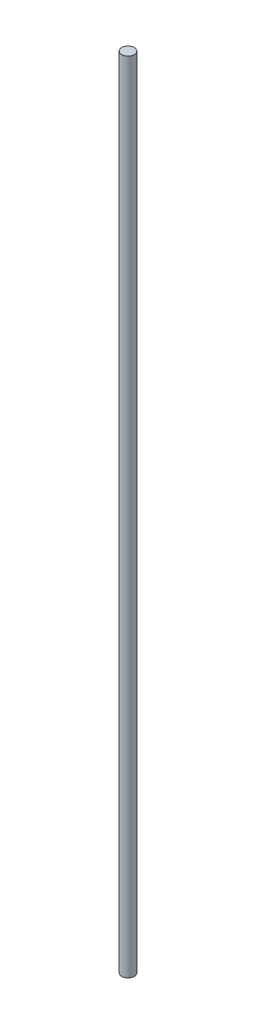
ISO-10303-21;
HEADER;
FILE_DESCRIPTION(('STEP AP214'),'2;1');
FILE_NAME('part.step','',(''),(''),'','','');
FILE_SCHEMA(('AUTOMOTIVE_DESIGN { 1 0 10303 214 1 1 1 1 }'));
ENDSEC;
DATA;
#1=APPLICATION_CONTEXT('core data for automotive mechanical design processes');
#2=APPLICATION_PROTOCOL_DEFINITION('international standard','automotive_design',2000,#1);
#3=PRODUCT_CONTEXT('',#1,'mechanical');
#4=PRODUCT('Part','Part','',(#3));
#5=PRODUCT_RELATED_PRODUCT_CATEGORY('part','',(#4));
#6=PRODUCT_DEFINITION_FORMATION('','',#4);
#7=PRODUCT_DEFINITION_CONTEXT('part definition',#1,'design');
#8=PRODUCT_DEFINITION('design','',#6,#7);
#9=PRODUCT_DEFINITION_SHAPE('','',#8);
#10=(LENGTH_UNIT() NAMED_UNIT(*) SI_UNIT(.MILLI.,.METRE.));
#11=(NAMED_UNIT(*) PLANE_ANGLE_UNIT() SI_UNIT($,.RADIAN.));
#12=(NAMED_UNIT(*) SI_UNIT($,.STERADIAN.) SOLID_ANGLE_UNIT());
#13=UNCERTAINTY_MEASURE_WITH_UNIT(LENGTH_MEASURE(1.E-05),#10,'distance_accuracy_value','');
#14=(GEOMETRIC_REPRESENTATION_CONTEXT(3) GLOBAL_UNCERTAINTY_ASSIGNED_CONTEXT((#13)) GLOBAL_UNIT_ASSIGNED_CONTEXT((#10,
#11,#12)) REPRESENTATION_CONTEXT('',''));
#15=CARTESIAN_POINT('',(0.,0.,0.));
#16=DIRECTION('',(0.,0.,1.));
#17=DIRECTION('',(1.,0.,0.));
#18=AXIS2_PLACEMENT_3D('',#15,#16,#17);
#19=CARTESIAN_POINT('',(0.,203.2,0.));
#20=DIRECTION('',(0.,-1.,0.));
#21=DIRECTION('',(0.,0.,-1.));
#22=AXIS2_PLACEMENT_3D('',#19,#20,#21);
#23=CYLINDRICAL_SURFACE('',#22,1.5875);
#24=CARTESIAN_POINT('',(0.,203.2,0.));
#25=DIRECTION('',(0.,1.,0.));
#26=DIRECTION('',(0.,0.,1.));
#27=AXIS2_PLACEMENT_3D('',#24,#25,#26);
#28=CIRCLE('',#27,1.5875);
#29=CARTESIAN_POINT('',(0.,203.2,1.5875));
#30=VERTEX_POINT('',#29);
#31=EDGE_CURVE('E10',#30,#30,#28,.T.);
#32=ORIENTED_EDGE('',*,*,#31,.F.);
#33=EDGE_LOOP('',(#32));
#34=FACE_BOUND('',#33,.T.);
#35=CARTESIAN_POINT('',(0.,0.,0.));
#36=DIRECTION('',(0.,1.,0.));
#37=DIRECTION('',(0.,0.,1.));
#38=AXIS2_PLACEMENT_3D('',#35,#36,#37);
#39=CIRCLE('',#38,1.5875);
#40=CARTESIAN_POINT('',(0.,0.,1.5875));
#41=VERTEX_POINT('',#40);
#42=EDGE_CURVE('E34',#41,#41,#39,.T.);
#43=ORIENTED_EDGE('',*,*,#42,.T.);
#44=EDGE_LOOP('',(#43));
#45=FACE_BOUND('',#44,.T.);
#46=ADVANCED_FACE('F31',(#34,#45),#23,.T.);
#47=CARTESIAN_POINT('',(0.,203.2,0.));
#48=DIRECTION('',(0.,1.,0.));
#49=DIRECTION('',(0.,0.,1.));
#50=AXIS2_PLACEMENT_3D('',#47,#48,#49);
#51=PLANE('',#50);
#52=ORIENTED_EDGE('',*,*,#31,.T.);
#53=EDGE_LOOP('',(#52));
#54=FACE_BOUND('',#53,.T.);
#55=ADVANCED_FACE('F46',(#54),#51,.T.);
#56=CARTESIAN_POINT('',(0.,0.,0.));
#57=DIRECTION('',(0.,1.,0.));
#58=DIRECTION('',(0.,0.,1.));
#59=AXIS2_PLACEMENT_3D('',#56,#57,#58);
#60=PLANE('',#59);
#61=ORIENTED_EDGE('',*,*,#42,.F.);
#62=EDGE_LOOP('',(#61));
#63=FACE_BOUND('',#62,.T.);
#64=ADVANCED_FACE('F44',(#63),#60,.F.);
#65=CLOSED_SHELL('',(#46,#55,#64));
#66=MANIFOLD_SOLID_BREP('B2',#65);
#67=ADVANCED_BREP_SHAPE_REPRESENTATION('',(#18,#66),#14);
#68=SHAPE_DEFINITION_REPRESENTATION(#9,#67);
ENDSEC;
END-ISO-10303-21;
